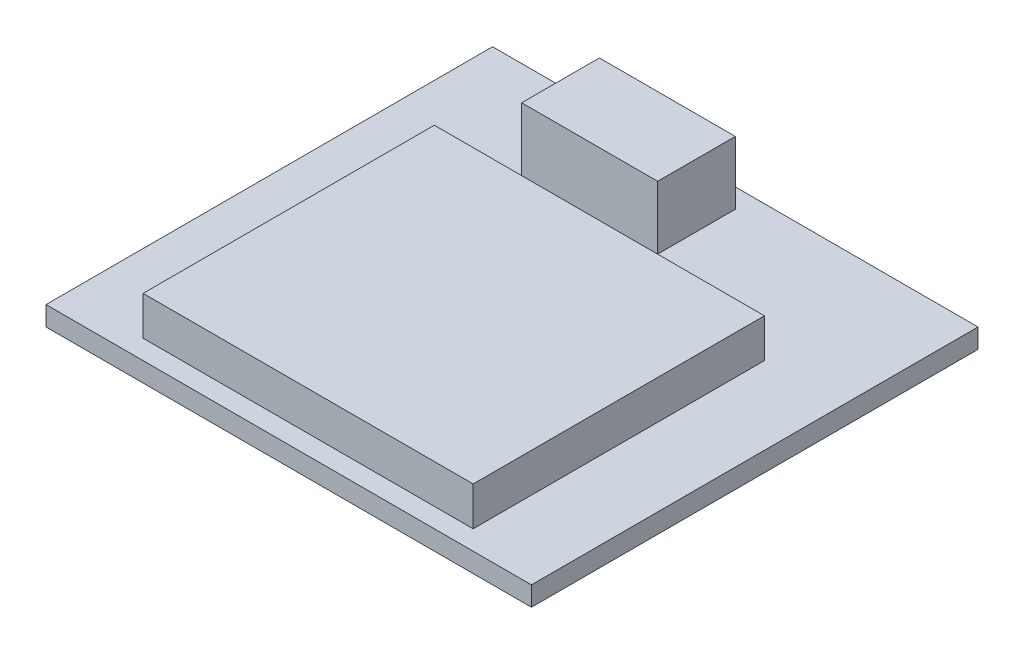
ISO-10303-21;
HEADER;
FILE_DESCRIPTION(('STEP AP214'),'2;1');
FILE_NAME('part.step','',(''),(''),'','','');
FILE_SCHEMA(('AUTOMOTIVE_DESIGN { 1 0 10303 214 1 1 1 1 }'));
ENDSEC;
DATA;
#1=APPLICATION_CONTEXT('core data for automotive mechanical design processes');
#2=APPLICATION_PROTOCOL_DEFINITION('international standard','automotive_design',2000,#1);
#3=PRODUCT_CONTEXT('',#1,'mechanical');
#4=PRODUCT('Part','Part','',(#3));
#5=PRODUCT_RELATED_PRODUCT_CATEGORY('part','',(#4));
#6=PRODUCT_DEFINITION_FORMATION('','',#4);
#7=PRODUCT_DEFINITION_CONTEXT('part definition',#1,'design');
#8=PRODUCT_DEFINITION('design','',#6,#7);
#9=PRODUCT_DEFINITION_SHAPE('','',#8);
#10=(LENGTH_UNIT() NAMED_UNIT(*) SI_UNIT(.MILLI.,.METRE.));
#11=(NAMED_UNIT(*) PLANE_ANGLE_UNIT() SI_UNIT($,.RADIAN.));
#12=(NAMED_UNIT(*) SI_UNIT($,.STERADIAN.) SOLID_ANGLE_UNIT());
#13=UNCERTAINTY_MEASURE_WITH_UNIT(LENGTH_MEASURE(1.E-05),#10,'distance_accuracy_value','');
#14=(GEOMETRIC_REPRESENTATION_CONTEXT(3) GLOBAL_UNCERTAINTY_ASSIGNED_CONTEXT((#13)) GLOBAL_UNIT_ASSIGNED_CONTEXT((#10,
#11,#12)) REPRESENTATION_CONTEXT('',''));
#15=CARTESIAN_POINT('',(0.,0.,0.));
#16=DIRECTION('',(0.,0.,1.));
#17=DIRECTION('',(1.,0.,0.));
#18=AXIS2_PLACEMENT_3D('',#15,#16,#17);
#19=CARTESIAN_POINT('',(-7.5,-0.75,-11.5));
#20=DIRECTION('',(1.,0.,0.));
#21=DIRECTION('',(0.,0.,-1.));
#22=AXIS2_PLACEMENT_3D('',#19,#20,#21);
#23=PLANE('',#22);
#24=DIRECTION('',(0.,0.,-1.));
#25=VECTOR('',#24,1.);
#26=CARTESIAN_POINT('',(-7.5,0.,-11.5));
#27=LINE('',#26,#25);
#28=CARTESIAN_POINT('',(-7.5,0.,5.50000000000001));
#29=VERTEX_POINT('',#28);
#30=CARTESIAN_POINT('',(-7.5,0.,-11.5));
#31=VERTEX_POINT('',#30);
#32=EDGE_CURVE('E165',#29,#31,#27,.T.);
#33=ORIENTED_EDGE('',*,*,#32,.T.);
#34=DIRECTION('',(0.,1.,0.));
#35=VECTOR('',#34,1.);
#36=CARTESIAN_POINT('',(-7.5,-0.75,-11.5));
#37=LINE('',#36,#35);
#38=CARTESIAN_POINT('',(-7.5,-0.75,-11.5));
#39=VERTEX_POINT('',#38);
#40=EDGE_CURVE('E12',#39,#31,#37,.T.);
#41=ORIENTED_EDGE('',*,*,#40,.F.);
#42=DIRECTION('',(0.,0.,-1.));
#43=VECTOR('',#42,1.);
#44=CARTESIAN_POINT('',(-7.5,-0.75,-11.5));
#45=LINE('',#44,#43);
#46=CARTESIAN_POINT('',(-7.5,-0.75,5.50000000000001));
#47=VERTEX_POINT('',#46);
#48=EDGE_CURVE('E169',#47,#39,#45,.T.);
#49=ORIENTED_EDGE('',*,*,#48,.F.);
#50=DIRECTION('',(0.,1.,0.));
#51=VECTOR('',#50,1.);
#52=CARTESIAN_POINT('',(-7.5,-0.75,5.50000000000001));
#53=LINE('',#52,#51);
#54=EDGE_CURVE('E175',#47,#29,#53,.T.);
#55=ORIENTED_EDGE('',*,*,#54,.T.);
#56=EDGE_LOOP('',(#33,#41,#49,#55));
#57=FACE_BOUND('',#56,.T.);
#58=ADVANCED_FACE('F52',(#57),#23,.F.);
#59=CARTESIAN_POINT('',(7.5,-0.75,-11.5));
#60=DIRECTION('',(0.,0.,1.));
#61=DIRECTION('',(1.,0.,0.));
#62=AXIS2_PLACEMENT_3D('',#59,#60,#61);
#63=PLANE('',#62);
#64=DIRECTION('',(-1.,0.,0.));
#65=VECTOR('',#64,1.);
#66=CARTESIAN_POINT('',(5.,-0.7,-11.5));
#67=LINE('',#66,#65);
#68=CARTESIAN_POINT('',(5.,-0.7,-11.5));
#69=VERTEX_POINT('',#68);
#70=CARTESIAN_POINT('',(-7.45,-0.7,-11.5));
#71=VERTEX_POINT('',#70);
#72=EDGE_CURVE('E159',#69,#71,#67,.T.);
#73=ORIENTED_EDGE('',*,*,#72,.F.);
#74=DIRECTION('',(0.,-1.,0.));
#75=VECTOR('',#74,1.);
#76=CARTESIAN_POINT('',(5.,-0.1,-11.5));
#77=LINE('',#76,#75);
#78=CARTESIAN_POINT('',(5.,-0.1,-11.5));
#79=VERTEX_POINT('',#78);
#80=EDGE_CURVE('E68',#79,#69,#77,.T.);
#81=ORIENTED_EDGE('',*,*,#80,.F.);
#82=DIRECTION('',(1.,0.,0.));
#83=VECTOR('',#82,1.);
#84=CARTESIAN_POINT('',(5.,-0.1,-11.5));
#85=LINE('',#84,#83);
#86=CARTESIAN_POINT('',(-7.45,-0.1,-11.5));
#87=VERTEX_POINT('',#86);
#88=EDGE_CURVE('E147',#87,#79,#85,.T.);
#89=ORIENTED_EDGE('',*,*,#88,.F.);
#90=DIRECTION('',(0.,1.,0.));
#91=VECTOR('',#90,1.);
#92=CARTESIAN_POINT('',(-7.45,-0.1,-11.5));
#93=LINE('',#92,#91);
#94=EDGE_CURVE('E150',#71,#87,#93,.T.);
#95=ORIENTED_EDGE('',*,*,#94,.F.);
#96=EDGE_LOOP('',(#73,#81,#89,#95));
#97=FACE_BOUND('',#96,.T.);
#98=DIRECTION('',(1.,0.,0.));
#99=VECTOR('',#98,1.);
#100=CARTESIAN_POINT('',(7.5,0.,-11.5));
#101=LINE('',#100,#99);
#102=CARTESIAN_POINT('',(7.5,0.,-11.5));
#103=VERTEX_POINT('',#102);
#104=EDGE_CURVE('E178',#31,#103,#101,.T.);
#105=ORIENTED_EDGE('',*,*,#104,.T.);
#106=DIRECTION('',(0.,1.,0.));
#107=VECTOR('',#106,1.);
#108=CARTESIAN_POINT('',(7.5,-0.75,-11.5));
#109=LINE('',#108,#107);
#110=CARTESIAN_POINT('',(7.5,-0.75,-11.5));
#111=VERTEX_POINT('',#110);
#112=EDGE_CURVE('E60',#111,#103,#109,.T.);
#113=ORIENTED_EDGE('',*,*,#112,.F.);
#114=DIRECTION('',(1.,0.,0.));
#115=VECTOR('',#114,1.);
#116=CARTESIAN_POINT('',(7.5,-0.75,-11.5));
#117=LINE('',#116,#115);
#118=EDGE_CURVE('E105',#39,#111,#117,.T.);
#119=ORIENTED_EDGE('',*,*,#118,.F.);
#120=ORIENTED_EDGE('',*,*,#40,.T.);
#121=EDGE_LOOP('',(#105,#113,#119,#120));
#122=FACE_BOUND('',#121,.T.);
#123=ADVANCED_FACE('F227',(#97,#122),#63,.F.);
#124=CARTESIAN_POINT('',(7.5,-0.75,-11.5));
#125=DIRECTION('',(-1.,0.,0.));
#126=DIRECTION('',(0.,0.,1.));
#127=AXIS2_PLACEMENT_3D('',#124,#125,#126);
#128=PLANE('',#127);
#129=DIRECTION('',(0.,0.,1.));
#130=VECTOR('',#129,1.);
#131=CARTESIAN_POINT('',(7.5,0.,-11.5));
#132=LINE('',#131,#130);
#133=CARTESIAN_POINT('',(7.5,0.,5.50000000000001));
#134=VERTEX_POINT('',#133);
#135=EDGE_CURVE('E180',#103,#134,#132,.T.);
#136=ORIENTED_EDGE('',*,*,#135,.T.);
#137=DIRECTION('',(0.,1.,0.));
#138=VECTOR('',#137,1.);
#139=CARTESIAN_POINT('',(7.5,-0.75,5.50000000000001));
#140=LINE('',#139,#138);
#141=CARTESIAN_POINT('',(7.5,-0.75,5.50000000000001));
#142=VERTEX_POINT('',#141);
#143=EDGE_CURVE('E184',#142,#134,#140,.T.);
#144=ORIENTED_EDGE('',*,*,#143,.F.);
#145=DIRECTION('',(0.,0.,1.));
#146=VECTOR('',#145,1.);
#147=CARTESIAN_POINT('',(7.5,-0.75,-11.5));
#148=LINE('',#147,#146);
#149=EDGE_CURVE('E172',#111,#142,#148,.T.);
#150=ORIENTED_EDGE('',*,*,#149,.F.);
#151=ORIENTED_EDGE('',*,*,#112,.T.);
#152=EDGE_LOOP('',(#136,#144,#150,#151));
#153=FACE_BOUND('',#152,.T.);
#154=ADVANCED_FACE('F232',(#153),#128,.F.);
#155=CARTESIAN_POINT('',(7.5,-0.75,5.50000000000001));
#156=DIRECTION('',(0.,0.,-1.));
#157=DIRECTION('',(-1.,0.,0.));
#158=AXIS2_PLACEMENT_3D('',#155,#156,#157);
#159=PLANE('',#158);
#160=DIRECTION('',(-1.,0.,0.));
#161=VECTOR('',#160,1.);
#162=CARTESIAN_POINT('',(7.5,0.,5.50000000000001));
#163=LINE('',#162,#161);
#164=EDGE_CURVE('E98',#134,#29,#163,.T.);
#165=ORIENTED_EDGE('',*,*,#164,.T.);
#166=ORIENTED_EDGE('',*,*,#54,.F.);
#167=DIRECTION('',(-1.,0.,0.));
#168=VECTOR('',#167,1.);
#169=CARTESIAN_POINT('',(7.5,-0.75,5.50000000000001));
#170=LINE('',#169,#168);
#171=EDGE_CURVE('E77',#142,#47,#170,.T.);
#172=ORIENTED_EDGE('',*,*,#171,.F.);
#173=ORIENTED_EDGE('',*,*,#143,.T.);
#174=EDGE_LOOP('',(#165,#166,#172,#173));
#175=FACE_BOUND('',#174,.T.);
#176=ADVANCED_FACE('F245',(#175),#159,.F.);
#177=CARTESIAN_POINT('',(0.,-0.75,0.));
#178=DIRECTION('',(0.,-1.,0.));
#179=DIRECTION('',(0.,0.,-1.));
#180=AXIS2_PLACEMENT_3D('',#177,#178,#179);
#181=PLANE('',#180);
#182=CARTESIAN_POINT('',(-2.54744339050164,-0.75,-6.85644874538234));
#183=DIRECTION('',(0.,-1.,0.));
#184=DIRECTION('',(0.,0.,-1.));
#185=AXIS2_PLACEMENT_3D('',#182,#183,#184);
#186=CIRCLE('',#185,0.770478248680797);
#187=CARTESIAN_POINT('',(-2.54744339050164,-0.75,-7.62692699406314));
#188=VERTEX_POINT('',#187);
#189=EDGE_CURVE('E467',#188,#188,#186,.T.);
#190=ORIENTED_EDGE('',*,*,#189,.F.);
#191=EDGE_LOOP('',(#190));
#192=FACE_BOUND('',#191,.T.);
#193=CARTESIAN_POINT('',(3.45255660949826,-0.75,3.14355125461766));
#194=DIRECTION('',(0.,-1.,0.));
#195=DIRECTION('',(0.,0.,-1.));
#196=AXIS2_PLACEMENT_3D('',#193,#194,#195);
#197=CIRCLE('',#196,0.770478248680796);
#198=CARTESIAN_POINT('',(3.45255660949826,-0.75,2.37307300593686));
#199=VERTEX_POINT('',#198);
#200=EDGE_CURVE('E463',#199,#199,#197,.T.);
#201=ORIENTED_EDGE('',*,*,#200,.F.);
#202=EDGE_LOOP('',(#201));
#203=FACE_BOUND('',#202,.T.);
#204=CARTESIAN_POINT('',(0.452556609498259,-0.75,3.14355125461766));
#205=DIRECTION('',(0.,-1.,0.));
#206=DIRECTION('',(0.,0.,-1.));
#207=AXIS2_PLACEMENT_3D('',#204,#205,#206);
#208=CIRCLE('',#207,0.770478248680796);
#209=CARTESIAN_POINT('',(0.452556609498259,-0.75,2.37307300593686));
#210=VERTEX_POINT('',#209);
#211=EDGE_CURVE('E443',#210,#210,#208,.T.);
#212=ORIENTED_EDGE('',*,*,#211,.F.);
#213=EDGE_LOOP('',(#212));
#214=FACE_BOUND('',#213,.T.);
#215=CARTESIAN_POINT('',(-2.54744339050174,-0.75,3.14355125461766));
#216=DIRECTION('',(0.,-1.,0.));
#217=DIRECTION('',(0.,0.,-1.));
#218=AXIS2_PLACEMENT_3D('',#215,#216,#217);
#219=CIRCLE('',#218,0.770478248680796);
#220=CARTESIAN_POINT('',(-2.54744339050174,-0.75,2.37307300593686));
#221=VERTEX_POINT('',#220);
#222=EDGE_CURVE('E462',#221,#221,#219,.T.);
#223=ORIENTED_EDGE('',*,*,#222,.F.);
#224=EDGE_LOOP('',(#223));
#225=FACE_BOUND('',#224,.T.);
#226=CARTESIAN_POINT('',(0.452556609498363,-0.75,-6.85644874538234));
#227=DIRECTION('',(0.,-1.,0.));
#228=DIRECTION('',(0.,0.,-1.));
#229=AXIS2_PLACEMENT_3D('',#226,#227,#228);
#230=CIRCLE('',#229,0.770478248680797);
#231=CARTESIAN_POINT('',(0.452556609498363,-0.75,-7.62692699406314));
#232=VERTEX_POINT('',#231);
#233=EDGE_CURVE('E470',#232,#232,#230,.T.);
#234=ORIENTED_EDGE('',*,*,#233,.F.);
#235=EDGE_LOOP('',(#234));
#236=FACE_BOUND('',#235,.T.);
#237=CARTESIAN_POINT('',(3.45255660949836,-0.75,-6.85644874538234));
#238=DIRECTION('',(0.,-1.,0.));
#239=DIRECTION('',(0.,0.,-1.));
#240=AXIS2_PLACEMENT_3D('',#237,#238,#239);
#241=CIRCLE('',#240,0.770478248680797);
#242=CARTESIAN_POINT('',(3.45255660949836,-0.75,-7.62692699406314));
#243=VERTEX_POINT('',#242);
#244=EDGE_CURVE('E475',#243,#243,#241,.T.);
#245=ORIENTED_EDGE('',*,*,#244,.F.);
#246=EDGE_LOOP('',(#245));
#247=FACE_BOUND('',#246,.T.);
#248=CARTESIAN_POINT('',(-5.54744339050164,-0.75,-6.85644874538234));
#249=DIRECTION('',(0.,-1.,0.));
#250=DIRECTION('',(0.,0.,-1.));
#251=AXIS2_PLACEMENT_3D('',#248,#249,#250);
#252=CIRCLE('',#251,0.770478248680797);
#253=CARTESIAN_POINT('',(-5.54744339050164,-0.75,-7.62692699406314));
#254=VERTEX_POINT('',#253);
#255=EDGE_CURVE('E472',#254,#254,#252,.T.);
#256=ORIENTED_EDGE('',*,*,#255,.F.);
#257=EDGE_LOOP('',(#256));
#258=FACE_BOUND('',#257,.T.);
#259=CARTESIAN_POINT('',(-5.54744339050174,-0.75,3.14355125461766));
#260=DIRECTION('',(0.,-1.,0.));
#261=DIRECTION('',(0.,0.,-1.));
#262=AXIS2_PLACEMENT_3D('',#259,#260,#261);
#263=CIRCLE('',#262,0.770478248680796);
#264=CARTESIAN_POINT('',(-5.54744339050174,-0.75,2.37307300593686));
#265=VERTEX_POINT('',#264);
#266=EDGE_CURVE('E153',#265,#265,#263,.T.);
#267=ORIENTED_EDGE('',*,*,#266,.F.);
#268=EDGE_LOOP('',(#267));
#269=FACE_BOUND('',#268,.T.);
#270=ORIENTED_EDGE('',*,*,#48,.T.);
#271=ORIENTED_EDGE('',*,*,#118,.T.);
#272=ORIENTED_EDGE('',*,*,#149,.T.);
#273=ORIENTED_EDGE('',*,*,#171,.T.);
#274=EDGE_LOOP('',(#270,#271,#272,#273));
#275=FACE_BOUND('',#274,.T.);
#276=ADVANCED_FACE('F243',(#192,#203,#214,#225,#236,#247,#258,#269,#275),#181,.T.);
#277=CARTESIAN_POINT('',(0.,0.,0.));
#278=DIRECTION('',(0.,-1.,0.));
#279=DIRECTION('',(0.,0.,-1.));
#280=AXIS2_PLACEMENT_3D('',#277,#278,#279);
#281=PLANE('',#280);
#282=ORIENTED_EDGE('',*,*,#32,.F.);
#283=ORIENTED_EDGE('',*,*,#164,.F.);
#284=ORIENTED_EDGE('',*,*,#135,.F.);
#285=ORIENTED_EDGE('',*,*,#104,.F.);
#286=EDGE_LOOP('',(#282,#283,#284,#285));
#287=FACE_BOUND('',#286,.T.);
#288=ADVANCED_FACE('F238',(#287),#281,.F.);
#289=CARTESIAN_POINT('',(5.,-0.1,5.25000000000001));
#290=DIRECTION('',(1.,0.,0.));
#291=DIRECTION('',(0.,0.,-1.));
#292=AXIS2_PLACEMENT_3D('',#289,#290,#291);
#293=PLANE('',#292);
#294=ORIENTED_EDGE('',*,*,#80,.T.);
#295=DIRECTION('',(0.,0.,-1.));
#296=VECTOR('',#295,1.);
#297=CARTESIAN_POINT('',(5.,-0.7,5.25000000000001));
#298=LINE('',#297,#296);
#299=CARTESIAN_POINT('',(5.,-0.7,5.25000000000001));
#300=VERTEX_POINT('',#299);
#301=EDGE_CURVE('E125',#300,#69,#298,.T.);
#302=ORIENTED_EDGE('',*,*,#301,.F.);
#303=DIRECTION('',(0.,-1.,0.));
#304=VECTOR('',#303,1.);
#305=CARTESIAN_POINT('',(5.,-0.1,5.25000000000001));
#306=LINE('',#305,#304);
#307=CARTESIAN_POINT('',(5.,-0.1,5.25000000000001));
#308=VERTEX_POINT('',#307);
#309=EDGE_CURVE('E129',#308,#300,#306,.T.);
#310=ORIENTED_EDGE('',*,*,#309,.F.);
#311=DIRECTION('',(0.,0.,-1.));
#312=VECTOR('',#311,1.);
#313=CARTESIAN_POINT('',(5.,-0.1,5.25000000000001));
#314=LINE('',#313,#312);
#315=EDGE_CURVE('E163',#308,#79,#314,.T.);
#316=ORIENTED_EDGE('',*,*,#315,.T.);
#317=EDGE_LOOP('',(#294,#302,#310,#316));
#318=FACE_BOUND('',#317,.T.);
#319=ADVANCED_FACE('F127',(#318),#293,.F.);
#320=CARTESIAN_POINT('',(5.,-0.1,5.25000000000001));
#321=DIRECTION('',(0.,1.,0.));
#322=DIRECTION('',(0.,0.,1.));
#323=AXIS2_PLACEMENT_3D('',#320,#321,#322);
#324=PLANE('',#323);
#325=ORIENTED_EDGE('',*,*,#88,.T.);
#326=ORIENTED_EDGE('',*,*,#315,.F.);
#327=DIRECTION('',(1.,0.,0.));
#328=VECTOR('',#327,1.);
#329=CARTESIAN_POINT('',(5.,-0.1,5.25000000000001));
#330=LINE('',#329,#328);
#331=CARTESIAN_POINT('',(-7.45,-0.1,5.25000000000001));
#332=VERTEX_POINT('',#331);
#333=EDGE_CURVE('E135',#332,#308,#330,.T.);
#334=ORIENTED_EDGE('',*,*,#333,.F.);
#335=DIRECTION('',(0.,0.,-1.));
#336=VECTOR('',#335,1.);
#337=CARTESIAN_POINT('',(-7.45,-0.1,5.25000000000001));
#338=LINE('',#337,#336);
#339=EDGE_CURVE('E166',#332,#87,#338,.T.);
#340=ORIENTED_EDGE('',*,*,#339,.T.);
#341=EDGE_LOOP('',(#325,#326,#334,#340));
#342=FACE_BOUND('',#341,.T.);
#343=ADVANCED_FACE('F292',(#342),#324,.F.);
#344=CARTESIAN_POINT('',(-7.45,-0.1,5.25000000000001));
#345=DIRECTION('',(-1.,0.,0.));
#346=DIRECTION('',(0.,0.,1.));
#347=AXIS2_PLACEMENT_3D('',#344,#345,#346);
#348=PLANE('',#347);
#349=ORIENTED_EDGE('',*,*,#94,.T.);
#350=ORIENTED_EDGE('',*,*,#339,.F.);
#351=DIRECTION('',(0.,1.,0.));
#352=VECTOR('',#351,1.);
#353=CARTESIAN_POINT('',(-7.45,-0.1,5.25000000000001));
#354=LINE('',#353,#352);
#355=CARTESIAN_POINT('',(-7.45,-0.7,5.25000000000001));
#356=VERTEX_POINT('',#355);
#357=EDGE_CURVE('E143',#356,#332,#354,.T.);
#358=ORIENTED_EDGE('',*,*,#357,.F.);
#359=DIRECTION('',(0.,0.,-1.));
#360=VECTOR('',#359,1.);
#361=CARTESIAN_POINT('',(-7.45,-0.7,5.25000000000001));
#362=LINE('',#361,#360);
#363=EDGE_CURVE('E134',#356,#71,#362,.T.);
#364=ORIENTED_EDGE('',*,*,#363,.T.);
#365=EDGE_LOOP('',(#349,#350,#358,#364));
#366=FACE_BOUND('',#365,.T.);
#367=ADVANCED_FACE('F301',(#366),#348,.F.);
#368=CARTESIAN_POINT('',(5.,-0.7,5.25000000000001));
#369=DIRECTION('',(0.,-1.,0.));
#370=DIRECTION('',(0.,0.,-1.));
#371=AXIS2_PLACEMENT_3D('',#368,#369,#370);
#372=PLANE('',#371);
#373=CARTESIAN_POINT('',(-2.54744339050164,-0.7,-6.85644874538234));
#374=DIRECTION('',(0.,-1.,0.));
#375=DIRECTION('',(0.,0.,-1.));
#376=AXIS2_PLACEMENT_3D('',#373,#374,#375);
#377=CIRCLE('',#376,0.770478248680797);
#378=CARTESIAN_POINT('',(-2.54744339050164,-0.7,-7.62692699406314));
#379=VERTEX_POINT('',#378);
#380=EDGE_CURVE('E55',#379,#379,#377,.T.);
#381=ORIENTED_EDGE('',*,*,#380,.T.);
#382=EDGE_LOOP('',(#381));
#383=FACE_BOUND('',#382,.T.);
#384=CARTESIAN_POINT('',(3.45255660949826,-0.7,3.14355125461766));
#385=DIRECTION('',(0.,-1.,0.));
#386=DIRECTION('',(0.,0.,-1.));
#387=AXIS2_PLACEMENT_3D('',#384,#385,#386);
#388=CIRCLE('',#387,0.770478248680796);
#389=CARTESIAN_POINT('',(3.45255660949826,-0.7,2.37307300593686));
#390=VERTEX_POINT('',#389);
#391=EDGE_CURVE('E205',#390,#390,#388,.T.);
#392=ORIENTED_EDGE('',*,*,#391,.T.);
#393=EDGE_LOOP('',(#392));
#394=FACE_BOUND('',#393,.T.);
#395=CARTESIAN_POINT('',(0.452556609498259,-0.7,3.14355125461766));
#396=DIRECTION('',(0.,-1.,0.));
#397=DIRECTION('',(0.,0.,-1.));
#398=AXIS2_PLACEMENT_3D('',#395,#396,#397);
#399=CIRCLE('',#398,0.770478248680796);
#400=CARTESIAN_POINT('',(0.452556609498259,-0.7,2.37307300593686));
#401=VERTEX_POINT('',#400);
#402=EDGE_CURVE('E203',#401,#401,#399,.T.);
#403=ORIENTED_EDGE('',*,*,#402,.T.);
#404=EDGE_LOOP('',(#403));
#405=FACE_BOUND('',#404,.T.);
#406=CARTESIAN_POINT('',(-2.54744339050174,-0.7,3.14355125461766));
#407=DIRECTION('',(0.,-1.,0.));
#408=DIRECTION('',(0.,0.,-1.));
#409=AXIS2_PLACEMENT_3D('',#406,#407,#408);
#410=CIRCLE('',#409,0.770478248680796);
#411=CARTESIAN_POINT('',(-2.54744339050174,-0.7,2.37307300593686));
#412=VERTEX_POINT('',#411);
#413=EDGE_CURVE('E200',#412,#412,#410,.T.);
#414=ORIENTED_EDGE('',*,*,#413,.T.);
#415=EDGE_LOOP('',(#414));
#416=FACE_BOUND('',#415,.T.);
#417=CARTESIAN_POINT('',(0.452556609498363,-0.7,-6.85644874538234));
#418=DIRECTION('',(0.,-1.,0.));
#419=DIRECTION('',(0.,0.,-1.));
#420=AXIS2_PLACEMENT_3D('',#417,#418,#419);
#421=CIRCLE('',#420,0.770478248680797);
#422=CARTESIAN_POINT('',(0.452556609498363,-0.7,-7.62692699406314));
#423=VERTEX_POINT('',#422);
#424=EDGE_CURVE('E197',#423,#423,#421,.T.);
#425=ORIENTED_EDGE('',*,*,#424,.T.);
#426=EDGE_LOOP('',(#425));
#427=FACE_BOUND('',#426,.T.);
#428=CARTESIAN_POINT('',(3.45255660949836,-0.7,-6.85644874538234));
#429=DIRECTION('',(0.,-1.,0.));
#430=DIRECTION('',(0.,0.,-1.));
#431=AXIS2_PLACEMENT_3D('',#428,#429,#430);
#432=CIRCLE('',#431,0.770478248680797);
#433=CARTESIAN_POINT('',(3.45255660949836,-0.7,-7.62692699406314));
#434=VERTEX_POINT('',#433);
#435=EDGE_CURVE('E194',#434,#434,#432,.T.);
#436=ORIENTED_EDGE('',*,*,#435,.T.);
#437=EDGE_LOOP('',(#436));
#438=FACE_BOUND('',#437,.T.);
#439=CARTESIAN_POINT('',(-5.54744339050164,-0.7,-6.85644874538234));
#440=DIRECTION('',(0.,-1.,0.));
#441=DIRECTION('',(0.,0.,-1.));
#442=AXIS2_PLACEMENT_3D('',#439,#440,#441);
#443=CIRCLE('',#442,0.770478248680797);
#444=CARTESIAN_POINT('',(-5.54744339050164,-0.7,-7.62692699406314));
#445=VERTEX_POINT('',#444);
#446=EDGE_CURVE('E191',#445,#445,#443,.T.);
#447=ORIENTED_EDGE('',*,*,#446,.T.);
#448=EDGE_LOOP('',(#447));
#449=FACE_BOUND('',#448,.T.);
#450=CARTESIAN_POINT('',(-5.54744339050174,-0.7,3.14355125461766));
#451=DIRECTION('',(0.,-1.,0.));
#452=DIRECTION('',(0.,0.,-1.));
#453=AXIS2_PLACEMENT_3D('',#450,#451,#452);
#454=CIRCLE('',#453,0.770478248680796);
#455=CARTESIAN_POINT('',(-5.54744339050174,-0.7,2.37307300593686));
#456=VERTEX_POINT('',#455);
#457=EDGE_CURVE('E188',#456,#456,#454,.T.);
#458=ORIENTED_EDGE('',*,*,#457,.T.);
#459=EDGE_LOOP('',(#458));
#460=FACE_BOUND('',#459,.T.);
#461=ORIENTED_EDGE('',*,*,#72,.T.);
#462=ORIENTED_EDGE('',*,*,#363,.F.);
#463=DIRECTION('',(-1.,0.,0.));
#464=VECTOR('',#463,1.);
#465=CARTESIAN_POINT('',(5.,-0.7,5.25000000000001));
#466=LINE('',#465,#464);
#467=EDGE_CURVE('E138',#300,#356,#466,.T.);
#468=ORIENTED_EDGE('',*,*,#467,.F.);
#469=ORIENTED_EDGE('',*,*,#301,.T.);
#470=EDGE_LOOP('',(#461,#462,#468,#469));
#471=FACE_BOUND('',#470,.T.);
#472=ADVANCED_FACE('F139',(#383,#394,#405,#416,#427,#438,#449,#460,#471),#372,.F.);
#473=CARTESIAN_POINT('',(0.,0.,5.25000000000001));
#474=DIRECTION('',(0.,0.,-1.));
#475=DIRECTION('',(-1.,0.,0.));
#476=AXIS2_PLACEMENT_3D('',#473,#474,#475);
#477=PLANE('',#476);
#478=ORIENTED_EDGE('',*,*,#309,.T.);
#479=ORIENTED_EDGE('',*,*,#467,.T.);
#480=ORIENTED_EDGE('',*,*,#357,.T.);
#481=ORIENTED_EDGE('',*,*,#333,.T.);
#482=EDGE_LOOP('',(#478,#479,#480,#481));
#483=FACE_BOUND('',#482,.T.);
#484=ADVANCED_FACE('F145',(#483),#477,.T.);
#485=CARTESIAN_POINT('',(-5.54744339050174,-0.25,3.14355125461766));
#486=DIRECTION('',(0.,-1.,0.));
#487=DIRECTION('',(0.,0.,-1.));
#488=AXIS2_PLACEMENT_3D('',#485,#486,#487);
#489=CYLINDRICAL_SURFACE('',#488,0.770478248680796);
#490=ORIENTED_EDGE('',*,*,#266,.T.);
#491=EDGE_LOOP('',(#490));
#492=FACE_BOUND('',#491,.T.);
#493=ORIENTED_EDGE('',*,*,#457,.F.);
#494=EDGE_LOOP('',(#493));
#495=FACE_BOUND('',#494,.T.);
#496=ADVANCED_FACE('F323',(#492,#495),#489,.F.);
#497=CARTESIAN_POINT('',(-5.54744339050164,-0.25,-6.85644874538234));
#498=DIRECTION('',(0.,-1.,0.));
#499=DIRECTION('',(0.,0.,-1.));
#500=AXIS2_PLACEMENT_3D('',#497,#498,#499);
#501=CYLINDRICAL_SURFACE('',#500,0.770478248680797);
#502=ORIENTED_EDGE('',*,*,#255,.T.);
#503=EDGE_LOOP('',(#502));
#504=FACE_BOUND('',#503,.T.);
#505=ORIENTED_EDGE('',*,*,#446,.F.);
#506=EDGE_LOOP('',(#505));
#507=FACE_BOUND('',#506,.T.);
#508=ADVANCED_FACE('F344',(#504,#507),#501,.F.);
#509=CARTESIAN_POINT('',(3.45255660949836,-0.25,-6.85644874538234));
#510=DIRECTION('',(0.,-1.,0.));
#511=DIRECTION('',(0.,0.,-1.));
#512=AXIS2_PLACEMENT_3D('',#509,#510,#511);
#513=CYLINDRICAL_SURFACE('',#512,0.770478248680797);
#514=ORIENTED_EDGE('',*,*,#244,.T.);
#515=EDGE_LOOP('',(#514));
#516=FACE_BOUND('',#515,.T.);
#517=ORIENTED_EDGE('',*,*,#435,.F.);
#518=EDGE_LOOP('',(#517));
#519=FACE_BOUND('',#518,.T.);
#520=ADVANCED_FACE('F355',(#516,#519),#513,.F.);
#521=CARTESIAN_POINT('',(0.452556609498363,-0.25,-6.85644874538234));
#522=DIRECTION('',(0.,-1.,0.));
#523=DIRECTION('',(0.,0.,-1.));
#524=AXIS2_PLACEMENT_3D('',#521,#522,#523);
#525=CYLINDRICAL_SURFACE('',#524,0.770478248680797);
#526=ORIENTED_EDGE('',*,*,#233,.T.);
#527=EDGE_LOOP('',(#526));
#528=FACE_BOUND('',#527,.T.);
#529=ORIENTED_EDGE('',*,*,#424,.F.);
#530=EDGE_LOOP('',(#529));
#531=FACE_BOUND('',#530,.T.);
#532=ADVANCED_FACE('F366',(#528,#531),#525,.F.);
#533=CARTESIAN_POINT('',(-2.54744339050174,-0.25,3.14355125461766));
#534=DIRECTION('',(0.,-1.,0.));
#535=DIRECTION('',(0.,0.,-1.));
#536=AXIS2_PLACEMENT_3D('',#533,#534,#535);
#537=CYLINDRICAL_SURFACE('',#536,0.770478248680796);
#538=ORIENTED_EDGE('',*,*,#222,.T.);
#539=EDGE_LOOP('',(#538));
#540=FACE_BOUND('',#539,.T.);
#541=ORIENTED_EDGE('',*,*,#413,.F.);
#542=EDGE_LOOP('',(#541));
#543=FACE_BOUND('',#542,.T.);
#544=ADVANCED_FACE('F377',(#540,#543),#537,.F.);
#545=CARTESIAN_POINT('',(0.452556609498259,-0.25,3.14355125461766));
#546=DIRECTION('',(0.,-1.,0.));
#547=DIRECTION('',(0.,0.,-1.));
#548=AXIS2_PLACEMENT_3D('',#545,#546,#547);
#549=CYLINDRICAL_SURFACE('',#548,0.770478248680796);
#550=ORIENTED_EDGE('',*,*,#211,.T.);
#551=EDGE_LOOP('',(#550));
#552=FACE_BOUND('',#551,.T.);
#553=ORIENTED_EDGE('',*,*,#402,.F.);
#554=EDGE_LOOP('',(#553));
#555=FACE_BOUND('',#554,.T.);
#556=ADVANCED_FACE('F221',(#552,#555),#549,.F.);
#557=CARTESIAN_POINT('',(3.45255660949826,-0.25,3.14355125461766));
#558=DIRECTION('',(0.,-1.,0.));
#559=DIRECTION('',(0.,0.,-1.));
#560=AXIS2_PLACEMENT_3D('',#557,#558,#559);
#561=CYLINDRICAL_SURFACE('',#560,0.770478248680796);
#562=ORIENTED_EDGE('',*,*,#200,.T.);
#563=EDGE_LOOP('',(#562));
#564=FACE_BOUND('',#563,.T.);
#565=ORIENTED_EDGE('',*,*,#391,.F.);
#566=EDGE_LOOP('',(#565));
#567=FACE_BOUND('',#566,.T.);
#568=ADVANCED_FACE('F215',(#564,#567),#561,.F.);
#569=CARTESIAN_POINT('',(-2.54744339050164,-0.25,-6.85644874538234));
#570=DIRECTION('',(0.,-1.,0.));
#571=DIRECTION('',(0.,0.,-1.));
#572=AXIS2_PLACEMENT_3D('',#569,#570,#571);
#573=CYLINDRICAL_SURFACE('',#572,0.770478248680797);
#574=ORIENTED_EDGE('',*,*,#189,.T.);
#575=EDGE_LOOP('',(#574));
#576=FACE_BOUND('',#575,.T.);
#577=ORIENTED_EDGE('',*,*,#380,.F.);
#578=EDGE_LOOP('',(#577));
#579=FACE_BOUND('',#578,.T.);
#580=ADVANCED_FACE('F213',(#576,#579),#573,.F.);
#581=CLOSED_SHELL('',(#58,#123,#154,#176,#276,#288,#319,#343,#367,#472,#484,#496,#508,#520,#532,
#544,#556,#568,#580));
#582=MANIFOLD_SOLID_BREP('B2',#581);
#583=CARTESIAN_POINT('',(0.,1.,0.));
#584=DIRECTION('',(0.,-1.,0.));
#585=DIRECTION('',(0.,0.,-1.));
#586=AXIS2_PLACEMENT_3D('',#583,#584,#585);
#587=PLANE('',#586);
#588=DIRECTION('',(0.,0.,-1.));
#589=VECTOR('',#588,1.);
#590=CARTESIAN_POINT('',(8.5,1.,10.5));
#591=LINE('',#590,#589);
#592=CARTESIAN_POINT('',(8.5,1.,10.5));
#593=VERTEX_POINT('',#592);
#594=CARTESIAN_POINT('',(8.5,1.,-4.5));
#595=VERTEX_POINT('',#594);
#596=EDGE_CURVE('E610',#593,#595,#591,.T.);
#597=ORIENTED_EDGE('',*,*,#596,.F.);
#598=DIRECTION('',(1.,0.,0.));
#599=VECTOR('',#598,1.);
#600=CARTESIAN_POINT('',(-8.5,1.,10.5));
#601=LINE('',#600,#599);
#602=CARTESIAN_POINT('',(-8.5,1.,10.5));
#603=VERTEX_POINT('',#602);
#604=EDGE_CURVE('E626',#603,#593,#601,.T.);
#605=ORIENTED_EDGE('',*,*,#604,.F.);
#606=DIRECTION('',(0.,0.,1.));
#607=VECTOR('',#606,1.);
#608=CARTESIAN_POINT('',(-8.5,1.,10.5));
#609=LINE('',#608,#607);
#610=CARTESIAN_POINT('',(-8.5,1.,-4.5));
#611=VERTEX_POINT('',#610);
#612=EDGE_CURVE('E639',#611,#603,#609,.T.);
#613=ORIENTED_EDGE('',*,*,#612,.F.);
#614=DIRECTION('',(-1.,0.,0.));
#615=VECTOR('',#614,1.);
#616=CARTESIAN_POINT('',(-8.5,1.,-4.5));
#617=LINE('',#616,#615);
#618=EDGE_CURVE('E615',#595,#611,#617,.T.);
#619=ORIENTED_EDGE('',*,*,#618,.F.);
#620=EDGE_LOOP('',(#597,#605,#613,#619));
#621=FACE_BOUND('',#620,.T.);
#622=DIRECTION('',(0.,0.,-1.));
#623=VECTOR('',#622,1.);
#624=CARTESIAN_POINT('',(12.5,1.,11.5));
#625=LINE('',#624,#623);
#626=CARTESIAN_POINT('',(12.5,1.,11.5));
#627=VERTEX_POINT('',#626);
#628=CARTESIAN_POINT('',(12.5,1.,-11.5));
#629=VERTEX_POINT('',#628);
#630=EDGE_CURVE('E662',#627,#629,#625,.T.);
#631=ORIENTED_EDGE('',*,*,#630,.T.);
#632=DIRECTION('',(-1.,0.,0.));
#633=VECTOR('',#632,1.);
#634=CARTESIAN_POINT('',(-12.5,1.,-11.5));
#635=LINE('',#634,#633);
#636=CARTESIAN_POINT('',(-12.5,1.,-11.5));
#637=VERTEX_POINT('',#636);
#638=EDGE_CURVE('E666',#629,#637,#635,.T.);
#639=ORIENTED_EDGE('',*,*,#638,.T.);
#640=DIRECTION('',(0.,0.,1.));
#641=VECTOR('',#640,1.);
#642=CARTESIAN_POINT('',(-12.5,1.,11.5));
#643=LINE('',#642,#641);
#644=CARTESIAN_POINT('',(-12.5,1.,11.5));
#645=VERTEX_POINT('',#644);
#646=EDGE_CURVE('E670',#637,#645,#643,.T.);
#647=ORIENTED_EDGE('',*,*,#646,.T.);
#648=DIRECTION('',(1.,0.,0.));
#649=VECTOR('',#648,1.);
#650=CARTESIAN_POINT('',(-12.5,1.,11.5));
#651=LINE('',#650,#649);
#652=EDGE_CURVE('E673',#645,#627,#651,.T.);
#653=ORIENTED_EDGE('',*,*,#652,.T.);
#654=EDGE_LOOP('',(#631,#639,#647,#653));
#655=FACE_BOUND('',#654,.T.);
#656=DIRECTION('',(0.,0.,-1.));
#657=VECTOR('',#656,1.);
#658=CARTESIAN_POINT('',(0.999999999999997,1.,-10.5));
#659=LINE('',#658,#657);
#660=CARTESIAN_POINT('',(0.999999999999997,1.,-6.5));
#661=VERTEX_POINT('',#660);
#662=CARTESIAN_POINT('',(0.999999999999997,1.,-10.5));
#663=VERTEX_POINT('',#662);
#664=EDGE_CURVE('E608',#661,#663,#659,.T.);
#665=ORIENTED_EDGE('',*,*,#664,.F.);
#666=DIRECTION('',(1.,0.,0.));
#667=VECTOR('',#666,1.);
#668=CARTESIAN_POINT('',(-6.,1.,-6.5));
#669=LINE('',#668,#667);
#670=CARTESIAN_POINT('',(-6.,1.,-6.5));
#671=VERTEX_POINT('',#670);
#672=EDGE_CURVE('E605',#671,#661,#669,.T.);
#673=ORIENTED_EDGE('',*,*,#672,.F.);
#674=DIRECTION('',(0.,0.,1.));
#675=VECTOR('',#674,1.);
#676=CARTESIAN_POINT('',(-6.,1.,-10.5));
#677=LINE('',#676,#675);
#678=CARTESIAN_POINT('',(-6.,1.,-10.5));
#679=VERTEX_POINT('',#678);
#680=EDGE_CURVE('E517',#679,#671,#677,.T.);
#681=ORIENTED_EDGE('',*,*,#680,.F.);
#682=DIRECTION('',(-1.,0.,0.));
#683=VECTOR('',#682,1.);
#684=CARTESIAN_POINT('',(-6.,1.,-10.5));
#685=LINE('',#684,#683);
#686=EDGE_CURVE('E512',#663,#679,#685,.T.);
#687=ORIENTED_EDGE('',*,*,#686,.F.);
#688=EDGE_LOOP('',(#665,#673,#681,#687));
#689=FACE_BOUND('',#688,.T.);
#690=ADVANCED_FACE('F496',(#621,#655,#689),#587,.F.);
#691=CARTESIAN_POINT('',(12.5,1.,11.5));
#692=DIRECTION('',(-1.,0.,0.));
#693=DIRECTION('',(0.,0.,1.));
#694=AXIS2_PLACEMENT_3D('',#691,#692,#693);
#695=PLANE('',#694);
#696=DIRECTION('',(0.,0.,-1.));
#697=VECTOR('',#696,1.);
#698=CARTESIAN_POINT('',(12.5,0.,11.5));
#699=LINE('',#698,#697);
#700=CARTESIAN_POINT('',(12.5,0.,11.5));
#701=VERTEX_POINT('',#700);
#702=CARTESIAN_POINT('',(12.5,0.,-11.5));
#703=VERTEX_POINT('',#702);
#704=EDGE_CURVE('E661',#701,#703,#699,.T.);
#705=ORIENTED_EDGE('',*,*,#704,.T.);
#706=DIRECTION('',(0.,-1.,0.));
#707=VECTOR('',#706,1.);
#708=CARTESIAN_POINT('',(12.5,1.,-11.5));
#709=LINE('',#708,#707);
#710=EDGE_CURVE('E50',#629,#703,#709,.T.);
#711=ORIENTED_EDGE('',*,*,#710,.F.);
#712=ORIENTED_EDGE('',*,*,#630,.F.);
#713=DIRECTION('',(0.,-1.,0.));
#714=VECTOR('',#713,1.);
#715=CARTESIAN_POINT('',(12.5,1.,11.5));
#716=LINE('',#715,#714);
#717=EDGE_CURVE('E676',#627,#701,#716,.T.);
#718=ORIENTED_EDGE('',*,*,#717,.T.);
#719=EDGE_LOOP('',(#705,#711,#712,#718));
#720=FACE_BOUND('',#719,.T.);
#721=ADVANCED_FACE('F498',(#720),#695,.F.);
#722=CARTESIAN_POINT('',(-12.5,1.,-11.5));
#723=DIRECTION('',(0.,0.,1.));
#724=DIRECTION('',(1.,0.,0.));
#725=AXIS2_PLACEMENT_3D('',#722,#723,#724);
#726=PLANE('',#725);
#727=DIRECTION('',(-1.,0.,0.));
#728=VECTOR('',#727,1.);
#729=CARTESIAN_POINT('',(-12.5,0.,-11.5));
#730=LINE('',#729,#728);
#731=CARTESIAN_POINT('',(-12.5,0.,-11.5));
#732=VERTEX_POINT('',#731);
#733=EDGE_CURVE('E680',#703,#732,#730,.T.);
#734=ORIENTED_EDGE('',*,*,#733,.T.);
#735=DIRECTION('',(0.,-1.,0.));
#736=VECTOR('',#735,1.);
#737=CARTESIAN_POINT('',(-12.5,1.,-11.5));
#738=LINE('',#737,#736);
#739=EDGE_CURVE('E505',#637,#732,#738,.T.);
#740=ORIENTED_EDGE('',*,*,#739,.F.);
#741=ORIENTED_EDGE('',*,*,#638,.F.);
#742=ORIENTED_EDGE('',*,*,#710,.T.);
#743=EDGE_LOOP('',(#734,#740,#741,#742));
#744=FACE_BOUND('',#743,.T.);
#745=ADVANCED_FACE('F715',(#744),#726,.F.);
#746=CARTESIAN_POINT('',(-12.5,1.,11.5));
#747=DIRECTION('',(1.,0.,0.));
#748=DIRECTION('',(0.,0.,-1.));
#749=AXIS2_PLACEMENT_3D('',#746,#747,#748);
#750=PLANE('',#749);
#751=DIRECTION('',(0.,0.,1.));
#752=VECTOR('',#751,1.);
#753=CARTESIAN_POINT('',(-12.5,0.,11.5));
#754=LINE('',#753,#752);
#755=CARTESIAN_POINT('',(-12.5,0.,11.5));
#756=VERTEX_POINT('',#755);
#757=EDGE_CURVE('E683',#732,#756,#754,.T.);
#758=ORIENTED_EDGE('',*,*,#757,.T.);
#759=DIRECTION('',(0.,-1.,0.));
#760=VECTOR('',#759,1.);
#761=CARTESIAN_POINT('',(-12.5,1.,11.5));
#762=LINE('',#761,#760);
#763=EDGE_CURVE('E691',#645,#756,#762,.T.);
#764=ORIENTED_EDGE('',*,*,#763,.F.);
#765=ORIENTED_EDGE('',*,*,#646,.F.);
#766=ORIENTED_EDGE('',*,*,#739,.T.);
#767=EDGE_LOOP('',(#758,#764,#765,#766));
#768=FACE_BOUND('',#767,.T.);
#769=ADVANCED_FACE('F700',(#768),#750,.F.);
#770=CARTESIAN_POINT('',(-12.5,1.,11.5));
#771=DIRECTION('',(0.,0.,-1.));
#772=DIRECTION('',(-1.,0.,0.));
#773=AXIS2_PLACEMENT_3D('',#770,#771,#772);
#774=PLANE('',#773);
#775=DIRECTION('',(1.,0.,0.));
#776=VECTOR('',#775,1.);
#777=CARTESIAN_POINT('',(-12.5,0.,11.5));
#778=LINE('',#777,#776);
#779=EDGE_CURVE('E667',#756,#701,#778,.T.);
#780=ORIENTED_EDGE('',*,*,#779,.T.);
#781=ORIENTED_EDGE('',*,*,#717,.F.);
#782=ORIENTED_EDGE('',*,*,#652,.F.);
#783=ORIENTED_EDGE('',*,*,#763,.T.);
#784=EDGE_LOOP('',(#780,#781,#782,#783));
#785=FACE_BOUND('',#784,.T.);
#786=ADVANCED_FACE('F709',(#785),#774,.F.);
#787=CARTESIAN_POINT('',(0.,0.,0.));
#788=DIRECTION('',(0.,-1.,0.));
#789=DIRECTION('',(0.,0.,-1.));
#790=AXIS2_PLACEMENT_3D('',#787,#788,#789);
#791=PLANE('',#790);
#792=ORIENTED_EDGE('',*,*,#704,.F.);
#793=ORIENTED_EDGE('',*,*,#779,.F.);
#794=ORIENTED_EDGE('',*,*,#757,.F.);
#795=ORIENTED_EDGE('',*,*,#733,.F.);
#796=EDGE_LOOP('',(#792,#793,#794,#795));
#797=FACE_BOUND('',#796,.T.);
#798=ADVANCED_FACE('F706',(#797),#791,.T.);
#799=CARTESIAN_POINT('',(8.5,3.,10.5));
#800=DIRECTION('',(-1.,0.,0.));
#801=DIRECTION('',(0.,0.,1.));
#802=AXIS2_PLACEMENT_3D('',#799,#800,#801);
#803=PLANE('',#802);
#804=ORIENTED_EDGE('',*,*,#596,.T.);
#805=DIRECTION('',(0.,-1.,0.));
#806=VECTOR('',#805,1.);
#807=CARTESIAN_POINT('',(8.5,3.,-4.5));
#808=LINE('',#807,#806);
#809=CARTESIAN_POINT('',(8.5,3.,-4.5));
#810=VERTEX_POINT('',#809);
#811=EDGE_CURVE('E657',#810,#595,#808,.T.);
#812=ORIENTED_EDGE('',*,*,#811,.F.);
#813=DIRECTION('',(0.,0.,-1.));
#814=VECTOR('',#813,1.);
#815=CARTESIAN_POINT('',(8.5,3.,10.5));
#816=LINE('',#815,#814);
#817=CARTESIAN_POINT('',(8.5,3.,10.5));
#818=VERTEX_POINT('',#817);
#819=EDGE_CURVE('E621',#818,#810,#816,.T.);
#820=ORIENTED_EDGE('',*,*,#819,.F.);
#821=DIRECTION('',(0.,-1.,0.));
#822=VECTOR('',#821,1.);
#823=CARTESIAN_POINT('',(8.5,3.,10.5));
#824=LINE('',#823,#822);
#825=EDGE_CURVE('E634',#818,#593,#824,.T.);
#826=ORIENTED_EDGE('',*,*,#825,.T.);
#827=EDGE_LOOP('',(#804,#812,#820,#826));
#828=FACE_BOUND('',#827,.T.);
#829=ADVANCED_FACE('F729',(#828),#803,.F.);
#830=CARTESIAN_POINT('',(-8.5,3.,-4.5));
#831=DIRECTION('',(0.,0.,1.));
#832=DIRECTION('',(1.,0.,0.));
#833=AXIS2_PLACEMENT_3D('',#830,#831,#832);
#834=PLANE('',#833);
#835=ORIENTED_EDGE('',*,*,#618,.T.);
#836=DIRECTION('',(0.,-1.,0.));
#837=VECTOR('',#836,1.);
#838=CARTESIAN_POINT('',(-8.5,3.,-4.5));
#839=LINE('',#838,#837);
#840=CARTESIAN_POINT('',(-8.5,3.,-4.5));
#841=VERTEX_POINT('',#840);
#842=EDGE_CURVE('E653',#841,#611,#839,.T.);
#843=ORIENTED_EDGE('',*,*,#842,.F.);
#844=DIRECTION('',(-1.,0.,0.));
#845=VECTOR('',#844,1.);
#846=CARTESIAN_POINT('',(-8.5,3.,-4.5));
#847=LINE('',#846,#845);
#848=EDGE_CURVE('E625',#810,#841,#847,.T.);
#849=ORIENTED_EDGE('',*,*,#848,.F.);
#850=ORIENTED_EDGE('',*,*,#811,.T.);
#851=EDGE_LOOP('',(#835,#843,#849,#850));
#852=FACE_BOUND('',#851,.T.);
#853=ADVANCED_FACE('F748',(#852),#834,.F.);
#854=CARTESIAN_POINT('',(-8.5,3.,10.5));
#855=DIRECTION('',(1.,0.,0.));
#856=DIRECTION('',(0.,0.,-1.));
#857=AXIS2_PLACEMENT_3D('',#854,#855,#856);
#858=PLANE('',#857);
#859=ORIENTED_EDGE('',*,*,#612,.T.);
#860=DIRECTION('',(0.,-1.,0.));
#861=VECTOR('',#860,1.);
#862=CARTESIAN_POINT('',(-8.5,3.,10.5));
#863=LINE('',#862,#861);
#864=CARTESIAN_POINT('',(-8.5,3.,10.5));
#865=VERTEX_POINT('',#864);
#866=EDGE_CURVE('E649',#865,#603,#863,.T.);
#867=ORIENTED_EDGE('',*,*,#866,.F.);
#868=DIRECTION('',(0.,0.,1.));
#869=VECTOR('',#868,1.);
#870=CARTESIAN_POINT('',(-8.5,3.,10.5));
#871=LINE('',#870,#869);
#872=EDGE_CURVE('E629',#841,#865,#871,.T.);
#873=ORIENTED_EDGE('',*,*,#872,.F.);
#874=ORIENTED_EDGE('',*,*,#842,.T.);
#875=EDGE_LOOP('',(#859,#867,#873,#874));
#876=FACE_BOUND('',#875,.T.);
#877=ADVANCED_FACE('F755',(#876),#858,.F.);
#878=CARTESIAN_POINT('',(-8.5,3.,10.5));
#879=DIRECTION('',(0.,0.,-1.));
#880=DIRECTION('',(-1.,0.,0.));
#881=AXIS2_PLACEMENT_3D('',#878,#879,#880);
#882=PLANE('',#881);
#883=ORIENTED_EDGE('',*,*,#604,.T.);
#884=ORIENTED_EDGE('',*,*,#825,.F.);
#885=DIRECTION('',(1.,0.,0.));
#886=VECTOR('',#885,1.);
#887=CARTESIAN_POINT('',(-8.5,3.,10.5));
#888=LINE('',#887,#886);
#889=EDGE_CURVE('E632',#865,#818,#888,.T.);
#890=ORIENTED_EDGE('',*,*,#889,.F.);
#891=ORIENTED_EDGE('',*,*,#866,.T.);
#892=EDGE_LOOP('',(#883,#884,#890,#891));
#893=FACE_BOUND('',#892,.T.);
#894=ADVANCED_FACE('F762',(#893),#882,.F.);
#895=CARTESIAN_POINT('',(0.,3.,0.));
#896=DIRECTION('',(0.,-1.,0.));
#897=DIRECTION('',(0.,0.,-1.));
#898=AXIS2_PLACEMENT_3D('',#895,#896,#897);
#899=PLANE('',#898);
#900=ORIENTED_EDGE('',*,*,#819,.T.);
#901=ORIENTED_EDGE('',*,*,#848,.T.);
#902=ORIENTED_EDGE('',*,*,#872,.T.);
#903=ORIENTED_EDGE('',*,*,#889,.T.);
#904=EDGE_LOOP('',(#900,#901,#902,#903));
#905=FACE_BOUND('',#904,.T.);
#906=ADVANCED_FACE('F770',(#905),#899,.F.);
#907=CARTESIAN_POINT('',(0.999999999999997,4.25,-10.5));
#908=DIRECTION('',(-1.,0.,0.));
#909=DIRECTION('',(0.,0.,1.));
#910=AXIS2_PLACEMENT_3D('',#907,#908,#909);
#911=PLANE('',#910);
#912=ORIENTED_EDGE('',*,*,#664,.T.);
#913=DIRECTION('',(0.,-1.,0.));
#914=VECTOR('',#913,1.);
#915=CARTESIAN_POINT('',(0.999999999999997,4.25,-10.5));
#916=LINE('',#915,#914);
#917=CARTESIAN_POINT('',(0.999999999999997,4.25,-10.5));
#918=VERTEX_POINT('',#917);
#919=EDGE_CURVE('E587',#918,#663,#916,.T.);
#920=ORIENTED_EDGE('',*,*,#919,.F.);
#921=DIRECTION('',(0.,0.,-1.));
#922=VECTOR('',#921,1.);
#923=CARTESIAN_POINT('',(0.999999999999997,4.25,-10.5));
#924=LINE('',#923,#922);
#925=CARTESIAN_POINT('',(0.999999999999997,4.25,-6.5));
#926=VERTEX_POINT('',#925);
#927=EDGE_CURVE('E595',#926,#918,#924,.T.);
#928=ORIENTED_EDGE('',*,*,#927,.F.);
#929=DIRECTION('',(0.,-1.,0.));
#930=VECTOR('',#929,1.);
#931=CARTESIAN_POINT('',(0.999999999999997,4.25,-6.5));
#932=LINE('',#931,#930);
#933=EDGE_CURVE('E891',#926,#661,#932,.T.);
#934=ORIENTED_EDGE('',*,*,#933,.T.);
#935=EDGE_LOOP('',(#912,#920,#928,#934));
#936=FACE_BOUND('',#935,.T.);
#937=ADVANCED_FACE('F607',(#936),#911,.F.);
#938=CARTESIAN_POINT('',(-6.,4.25,-10.5));
#939=DIRECTION('',(0.,0.,1.));
#940=DIRECTION('',(1.,0.,0.));
#941=AXIS2_PLACEMENT_3D('',#938,#939,#940);
#942=PLANE('',#941);
#943=ORIENTED_EDGE('',*,*,#686,.T.);
#944=DIRECTION('',(0.,-1.,0.));
#945=VECTOR('',#944,1.);
#946=CARTESIAN_POINT('',(-6.,4.25,-10.5));
#947=LINE('',#946,#945);
#948=CARTESIAN_POINT('',(-6.,4.25,-10.5));
#949=VERTEX_POINT('',#948);
#950=EDGE_CURVE('E590',#949,#679,#947,.T.);
#951=ORIENTED_EDGE('',*,*,#950,.F.);
#952=DIRECTION('',(-1.,0.,0.));
#953=VECTOR('',#952,1.);
#954=CARTESIAN_POINT('',(-6.,4.25,-10.5));
#955=LINE('',#954,#953);
#956=EDGE_CURVE('E583',#918,#949,#955,.T.);
#957=ORIENTED_EDGE('',*,*,#956,.F.);
#958=ORIENTED_EDGE('',*,*,#919,.T.);
#959=EDGE_LOOP('',(#943,#951,#957,#958));
#960=FACE_BOUND('',#959,.T.);
#961=ADVANCED_FACE('F585',(#960),#942,.F.);
#962=CARTESIAN_POINT('',(-6.,4.25,-10.5));
#963=DIRECTION('',(1.,0.,0.));
#964=DIRECTION('',(0.,0.,-1.));
#965=AXIS2_PLACEMENT_3D('',#962,#963,#964);
#966=PLANE('',#965);
#967=ORIENTED_EDGE('',*,*,#680,.T.);
#968=DIRECTION('',(0.,-1.,0.));
#969=VECTOR('',#968,1.);
#970=CARTESIAN_POINT('',(-6.,4.25,-6.5));
#971=LINE('',#970,#969);
#972=CARTESIAN_POINT('',(-6.,4.25,-6.5));
#973=VERTEX_POINT('',#972);
#974=EDGE_CURVE('E617',#973,#671,#971,.T.);
#975=ORIENTED_EDGE('',*,*,#974,.F.);
#976=DIRECTION('',(0.,0.,1.));
#977=VECTOR('',#976,1.);
#978=CARTESIAN_POINT('',(-6.,4.25,-10.5));
#979=LINE('',#978,#977);
#980=EDGE_CURVE('E594',#949,#973,#979,.T.);
#981=ORIENTED_EDGE('',*,*,#980,.F.);
#982=ORIENTED_EDGE('',*,*,#950,.T.);
#983=EDGE_LOOP('',(#967,#975,#981,#982));
#984=FACE_BOUND('',#983,.T.);
#985=ADVANCED_FACE('F791',(#984),#966,.F.);
#986=CARTESIAN_POINT('',(-6.,4.25,-6.5));
#987=DIRECTION('',(0.,0.,-1.));
#988=DIRECTION('',(-1.,0.,0.));
#989=AXIS2_PLACEMENT_3D('',#986,#987,#988);
#990=PLANE('',#989);
#991=ORIENTED_EDGE('',*,*,#672,.T.);
#992=ORIENTED_EDGE('',*,*,#933,.F.);
#993=DIRECTION('',(1.,0.,0.));
#994=VECTOR('',#993,1.);
#995=CARTESIAN_POINT('',(-6.,4.25,-6.5));
#996=LINE('',#995,#994);
#997=EDGE_CURVE('E600',#973,#926,#996,.T.);
#998=ORIENTED_EDGE('',*,*,#997,.F.);
#999=ORIENTED_EDGE('',*,*,#974,.T.);
#1000=EDGE_LOOP('',(#991,#992,#998,#999));
#1001=FACE_BOUND('',#1000,.T.);
#1002=ADVANCED_FACE('F798',(#1001),#990,.F.);
#1003=CARTESIAN_POINT('',(0.,4.25,0.));
#1004=DIRECTION('',(0.,1.,0.));
#1005=DIRECTION('',(0.,0.,1.));
#1006=AXIS2_PLACEMENT_3D('',#1003,#1004,#1005);
#1007=PLANE('',#1006);
#1008=ORIENTED_EDGE('',*,*,#927,.T.);
#1009=ORIENTED_EDGE('',*,*,#956,.T.);
#1010=ORIENTED_EDGE('',*,*,#980,.T.);
#1011=ORIENTED_EDGE('',*,*,#997,.T.);
#1012=EDGE_LOOP('',(#1008,#1009,#1010,#1011));
#1013=FACE_BOUND('',#1012,.T.);
#1014=ADVANCED_FACE('F598',(#1013),#1007,.T.);
#1015=CLOSED_SHELL('',(#690,#721,#745,#769,#786,#798,#829,#853,#877,#894,#906,#937,#961,#985,
#1002,#1014));
#1016=MANIFOLD_SOLID_BREP('B6',#1015);
#1017=ADVANCED_BREP_SHAPE_REPRESENTATION('',(#18,#582,#1016),#14);
#1018=SHAPE_DEFINITION_REPRESENTATION(#9,#1017);
ENDSEC;
END-ISO-10303-21;
